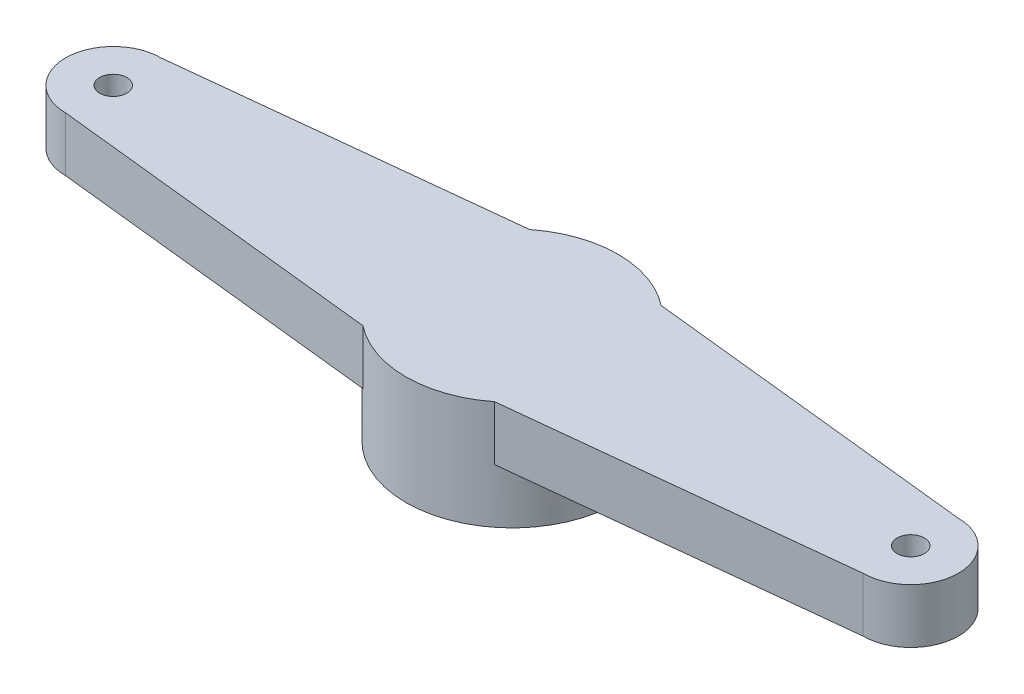
ISO-10303-21;
HEADER;
FILE_DESCRIPTION(('STEP AP214'),'2;1');
FILE_NAME('part.step','',(''),(''),'','','');
FILE_SCHEMA(('AUTOMOTIVE_DESIGN { 1 0 10303 214 1 1 1 1 }'));
ENDSEC;
DATA;
#1=APPLICATION_CONTEXT('core data for automotive mechanical design processes');
#2=APPLICATION_PROTOCOL_DEFINITION('international standard','automotive_design',2000,#1);
#3=PRODUCT_CONTEXT('',#1,'mechanical');
#4=PRODUCT('Part','Part','',(#3));
#5=PRODUCT_RELATED_PRODUCT_CATEGORY('part','',(#4));
#6=PRODUCT_DEFINITION_FORMATION('','',#4);
#7=PRODUCT_DEFINITION_CONTEXT('part definition',#1,'design');
#8=PRODUCT_DEFINITION('design','',#6,#7);
#9=PRODUCT_DEFINITION_SHAPE('','',#8);
#10=(LENGTH_UNIT() NAMED_UNIT(*) SI_UNIT(.MILLI.,.METRE.));
#11=(NAMED_UNIT(*) PLANE_ANGLE_UNIT() SI_UNIT($,.RADIAN.));
#12=(NAMED_UNIT(*) SI_UNIT($,.STERADIAN.) SOLID_ANGLE_UNIT());
#13=UNCERTAINTY_MEASURE_WITH_UNIT(LENGTH_MEASURE(1.E-05),#10,'distance_accuracy_value','');
#14=(GEOMETRIC_REPRESENTATION_CONTEXT(3) GLOBAL_UNCERTAINTY_ASSIGNED_CONTEXT((#13)) GLOBAL_UNIT_ASSIGNED_CONTEXT((#10,
#11,#12)) REPRESENTATION_CONTEXT('',''));
#15=CARTESIAN_POINT('',(0.,0.,0.));
#16=DIRECTION('',(0.,0.,1.));
#17=DIRECTION('',(1.,0.,0.));
#18=AXIS2_PLACEMENT_3D('',#15,#16,#17);
#19=CARTESIAN_POINT('',(-5.70664134658746,-2.,37.4291539918414));
#20=DIRECTION('',(0.,1.,0.));
#21=DIRECTION('',(0.,0.,1.));
#22=AXIS2_PLACEMENT_3D('',#19,#20,#21);
#23=CYLINDRICAL_SURFACE('',#22,3.9);
#24=CARTESIAN_POINT('',(-5.70664134658746,-2.,37.4291539918414));
#25=DIRECTION('',(0.,1.,0.));
#26=DIRECTION('',(0.,0.,1.));
#27=AXIS2_PLACEMENT_3D('',#24,#25,#26);
#28=CIRCLE('',#27,3.9);
#29=CARTESIAN_POINT('',(-5.70664134658746,-2.,41.3291539918414));
#30=VERTEX_POINT('',#29);
#31=EDGE_CURVE('E140',#30,#30,#28,.T.);
#32=ORIENTED_EDGE('',*,*,#31,.T.);
#33=EDGE_LOOP('',(#32));
#34=FACE_BOUND('',#33,.T.);
#35=CARTESIAN_POINT('',(-5.70664134658746,0.,37.4291539918414));
#36=DIRECTION('',(0.,-1.,0.));
#37=DIRECTION('',(0.,0.,-1.));
#38=AXIS2_PLACEMENT_3D('',#35,#36,#37);
#39=CIRCLE('',#38,3.9);
#40=CARTESIAN_POINT('',(-8.12308083620216,0.,34.3679744490784));
#41=VERTEX_POINT('',#40);
#42=CARTESIAN_POINT('',(-8.12308083620216,0.,40.4903335346044));
#43=VERTEX_POINT('',#42);
#44=EDGE_CURVE('E11',#41,#43,#39,.F.);
#45=ORIENTED_EDGE('',*,*,#44,.F.);
#46=DIRECTION('',(0.,1.,0.));
#47=VECTOR('',#46,1.);
#48=CARTESIAN_POINT('',(-8.12308083620216,-2.,34.3679744490784));
#49=LINE('',#48,#47);
#50=CARTESIAN_POINT('',(-8.12308083620216,2.,34.3679744490784));
#51=VERTEX_POINT('',#50);
#52=EDGE_CURVE('E134',#41,#51,#49,.T.);
#53=ORIENTED_EDGE('',*,*,#52,.T.);
#54=CARTESIAN_POINT('',(-5.70664134658746,2.,37.4291539918414));
#55=DIRECTION('',(0.,1.,0.));
#56=DIRECTION('',(0.,0.,1.));
#57=AXIS2_PLACEMENT_3D('',#54,#55,#56);
#58=CIRCLE('',#57,3.9);
#59=CARTESIAN_POINT('',(-3.29020185697275,2.,34.3679744490784));
#60=VERTEX_POINT('',#59);
#61=EDGE_CURVE('E139',#60,#51,#58,.T.);
#62=ORIENTED_EDGE('',*,*,#61,.F.);
#63=DIRECTION('',(0.,1.,0.));
#64=VECTOR('',#63,1.);
#65=CARTESIAN_POINT('',(-3.29020185697275,-2.,34.3679744490784));
#66=LINE('',#65,#64);
#67=CARTESIAN_POINT('',(-3.29020185697275,0.,34.3679744490784));
#68=VERTEX_POINT('',#67);
#69=EDGE_CURVE('E104',#60,#68,#66,.F.);
#70=ORIENTED_EDGE('',*,*,#69,.T.);
#71=CARTESIAN_POINT('',(-3.29020185697275,0.,40.4903335346044));
#72=VERTEX_POINT('',#71);
#73=EDGE_CURVE('E35',#72,#68,#39,.F.);
#74=ORIENTED_EDGE('',*,*,#73,.F.);
#75=DIRECTION('',(0.,1.,0.));
#76=VECTOR('',#75,1.);
#77=CARTESIAN_POINT('',(-3.29020185697275,-2.,40.4903335346044));
#78=LINE('',#77,#76);
#79=CARTESIAN_POINT('',(-3.29020185697275,2.,40.4903335346044));
#80=VERTEX_POINT('',#79);
#81=EDGE_CURVE('E122',#72,#80,#78,.T.);
#82=ORIENTED_EDGE('',*,*,#81,.T.);
#83=CARTESIAN_POINT('',(-8.12308083620216,2.,40.4903335346044));
#84=VERTEX_POINT('',#83);
#85=EDGE_CURVE('E138',#84,#80,#58,.T.);
#86=ORIENTED_EDGE('',*,*,#85,.F.);
#87=DIRECTION('',(0.,1.,0.));
#88=VECTOR('',#87,1.);
#89=CARTESIAN_POINT('',(-8.12308083620216,-2.,40.4903335346044));
#90=LINE('',#89,#88);
#91=EDGE_CURVE('E125',#84,#43,#90,.F.);
#92=ORIENTED_EDGE('',*,*,#91,.T.);
#93=EDGE_LOOP('',(#45,#53,#62,#70,#74,#82,#86,#92));
#94=FACE_BOUND('',#93,.T.);
#95=ADVANCED_FACE('F32',(#34,#94),#23,.T.);
#96=CARTESIAN_POINT('',(-5.70664134658746,-2.,37.4291539918414));
#97=DIRECTION('',(0.,1.,0.));
#98=DIRECTION('',(0.,0.,1.));
#99=AXIS2_PLACEMENT_3D('',#96,#97,#98);
#100=PLANE('',#99);
#101=CARTESIAN_POINT('',(-5.70664134658746,-2.,37.4291539918414));
#102=DIRECTION('',(0.,1.,0.));
#103=DIRECTION('',(0.,0.,1.));
#104=AXIS2_PLACEMENT_3D('',#101,#102,#103);
#105=CIRCLE('',#104,2.25);
#106=CARTESIAN_POINT('',(-5.70664134658746,-2.,39.6791539918414));
#107=VERTEX_POINT('',#106);
#108=EDGE_CURVE('E191',#107,#107,#105,.T.);
#109=ORIENTED_EDGE('',*,*,#108,.T.);
#110=EDGE_LOOP('',(#109));
#111=FACE_BOUND('',#110,.T.);
#112=ORIENTED_EDGE('',*,*,#31,.F.);
#113=EDGE_LOOP('',(#112));
#114=FACE_BOUND('',#113,.T.);
#115=ADVANCED_FACE('F200',(#111,#114),#100,.F.);
#116=CARTESIAN_POINT('',(-5.70664134658746,2.,37.4291539918414));
#117=DIRECTION('',(0.,1.,0.));
#118=DIRECTION('',(0.,0.,1.));
#119=AXIS2_PLACEMENT_3D('',#116,#117,#118);
#120=PLANE('',#119);
#121=ORIENTED_EDGE('',*,*,#85,.T.);
#122=DIRECTION('',(0.994305357259751,0.,-0.106568553169119));
#123=VECTOR('',#122,1.);
#124=CARTESIAN_POINT('',(8.94335865341254,2.,39.1791539918414));
#125=LINE('',#124,#123);
#126=CARTESIAN_POINT('',(8.94335865341254,2.,39.1791539918414));
#127=VERTEX_POINT('',#126);
#128=EDGE_CURVE('E53',#80,#127,#125,.T.);
#129=ORIENTED_EDGE('',*,*,#128,.T.);
#130=CARTESIAN_POINT('',(8.94335865341254,2.,37.4291539918414));
#131=DIRECTION('',(0.,1.,0.));
#132=DIRECTION('',(0.,0.,-1.));
#133=AXIS2_PLACEMENT_3D('',#130,#131,#132);
#134=CIRCLE('',#133,1.75);
#135=CARTESIAN_POINT('',(8.94335865341254,2.,35.6791539918414));
#136=VERTEX_POINT('',#135);
#137=EDGE_CURVE('E109',#127,#136,#134,.T.);
#138=ORIENTED_EDGE('',*,*,#137,.T.);
#139=DIRECTION('',(-0.994305357259751,0.,-0.106568553169119));
#140=VECTOR('',#139,1.);
#141=CARTESIAN_POINT('',(8.94335865341254,2.,35.6791539918414));
#142=LINE('',#141,#140);
#143=EDGE_CURVE('E96',#136,#60,#142,.T.);
#144=ORIENTED_EDGE('',*,*,#143,.T.);
#145=ORIENTED_EDGE('',*,*,#61,.T.);
#146=DIRECTION('',(-0.994305357259751,0.,0.106568553169119));
#147=VECTOR('',#146,1.);
#148=CARTESIAN_POINT('',(-20.3566413465875,2.,35.6791539918414));
#149=LINE('',#148,#147);
#150=CARTESIAN_POINT('',(-20.3566413465875,2.,35.6791539918414));
#151=VERTEX_POINT('',#150);
#152=EDGE_CURVE('E108',#51,#151,#149,.T.);
#153=ORIENTED_EDGE('',*,*,#152,.T.);
#154=CARTESIAN_POINT('',(-20.3566413465875,2.,37.4291539918414));
#155=DIRECTION('',(0.,1.,0.));
#156=DIRECTION('',(0.,0.,1.));
#157=AXIS2_PLACEMENT_3D('',#154,#155,#156);
#158=CIRCLE('',#157,1.75);
#159=CARTESIAN_POINT('',(-20.3566413465875,2.,39.1791539918414));
#160=VERTEX_POINT('',#159);
#161=EDGE_CURVE('E173',#151,#160,#158,.T.);
#162=ORIENTED_EDGE('',*,*,#161,.T.);
#163=DIRECTION('',(0.994305357259751,0.,0.106568553169119));
#164=VECTOR('',#163,1.);
#165=CARTESIAN_POINT('',(-20.3566413465875,2.,39.1791539918414));
#166=LINE('',#165,#164);
#167=EDGE_CURVE('E169',#160,#84,#166,.T.);
#168=ORIENTED_EDGE('',*,*,#167,.T.);
#169=EDGE_LOOP('',(#121,#129,#138,#144,#145,#153,#162,#168));
#170=FACE_BOUND('',#169,.T.);
#171=CARTESIAN_POINT('',(8.94335865341254,2.,37.4291539918414));
#172=DIRECTION('',(0.,1.,0.));
#173=DIRECTION('',(0.,0.,-1.));
#174=AXIS2_PLACEMENT_3D('',#171,#172,#173);
#175=CIRCLE('',#174,0.500000000000001);
#176=CARTESIAN_POINT('',(8.94335865341254,2.,36.9291539918414));
#177=VERTEX_POINT('',#176);
#178=EDGE_CURVE('E178',#177,#177,#175,.T.);
#179=ORIENTED_EDGE('',*,*,#178,.F.);
#180=EDGE_LOOP('',(#179));
#181=FACE_BOUND('',#180,.T.);
#182=CARTESIAN_POINT('',(-20.3566413465875,2.,37.4291539918414));
#183=DIRECTION('',(0.,1.,0.));
#184=DIRECTION('',(0.,0.,1.));
#185=AXIS2_PLACEMENT_3D('',#182,#183,#184);
#186=CIRCLE('',#185,0.499999999999999);
#187=CARTESIAN_POINT('',(-20.3566413465875,2.,37.9291539918414));
#188=VERTEX_POINT('',#187);
#189=EDGE_CURVE('E185',#188,#188,#186,.T.);
#190=ORIENTED_EDGE('',*,*,#189,.F.);
#191=EDGE_LOOP('',(#190));
#192=FACE_BOUND('',#191,.T.);
#193=ADVANCED_FACE('F113',(#170,#181,#192),#120,.T.);
#194=CARTESIAN_POINT('',(8.94335865341254,2.,37.4291539918414));
#195=DIRECTION('',(0.,-1.,0.));
#196=DIRECTION('',(0.,0.,-1.));
#197=AXIS2_PLACEMENT_3D('',#194,#195,#196);
#198=CYLINDRICAL_SURFACE('',#197,0.500000000000001);
#199=ORIENTED_EDGE('',*,*,#178,.T.);
#200=EDGE_LOOP('',(#199));
#201=FACE_BOUND('',#200,.T.);
#202=CARTESIAN_POINT('',(8.94335865341254,0.,37.4291539918414));
#203=DIRECTION('',(0.,1.,0.));
#204=DIRECTION('',(0.,0.,-1.));
#205=AXIS2_PLACEMENT_3D('',#202,#203,#204);
#206=CIRCLE('',#205,0.500000000000001);
#207=CARTESIAN_POINT('',(8.94335865341254,0.,36.9291539918414));
#208=VERTEX_POINT('',#207);
#209=EDGE_CURVE('E180',#208,#208,#206,.T.);
#210=ORIENTED_EDGE('',*,*,#209,.F.);
#211=EDGE_LOOP('',(#210));
#212=FACE_BOUND('',#211,.T.);
#213=ADVANCED_FACE('F222',(#201,#212),#198,.F.);
#214=CARTESIAN_POINT('',(8.94335865341254,2.,37.4291539918414));
#215=DIRECTION('',(0.,-1.,0.));
#216=DIRECTION('',(0.,0.,-1.));
#217=AXIS2_PLACEMENT_3D('',#214,#215,#216);
#218=CYLINDRICAL_SURFACE('',#217,1.75);
#219=CARTESIAN_POINT('',(8.94335865341254,0.,37.4291539918414));
#220=DIRECTION('',(0.,1.,0.));
#221=DIRECTION('',(0.,0.,-1.));
#222=AXIS2_PLACEMENT_3D('',#219,#220,#221);
#223=CIRCLE('',#222,1.75);
#224=CARTESIAN_POINT('',(8.94335865341254,0.,39.1791539918414));
#225=VERTEX_POINT('',#224);
#226=CARTESIAN_POINT('',(8.94335865341254,0.,35.6791539918414));
#227=VERTEX_POINT('',#226);
#228=EDGE_CURVE('E121',#225,#227,#223,.T.);
#229=ORIENTED_EDGE('',*,*,#228,.T.);
#230=DIRECTION('',(0.,-1.,0.));
#231=VECTOR('',#230,1.);
#232=CARTESIAN_POINT('',(8.94335865341254,2.,35.6791539918414));
#233=LINE('',#232,#231);
#234=EDGE_CURVE('E101',#136,#227,#233,.T.);
#235=ORIENTED_EDGE('',*,*,#234,.F.);
#236=ORIENTED_EDGE('',*,*,#137,.F.);
#237=DIRECTION('',(0.,-1.,0.));
#238=VECTOR('',#237,1.);
#239=CARTESIAN_POINT('',(8.94335865341254,2.,39.1791539918414));
#240=LINE('',#239,#238);
#241=EDGE_CURVE('E164',#127,#225,#240,.T.);
#242=ORIENTED_EDGE('',*,*,#241,.T.);
#243=EDGE_LOOP('',(#229,#235,#236,#242));
#244=FACE_BOUND('',#243,.T.);
#245=ADVANCED_FACE('F119',(#244),#218,.T.);
#246=CARTESIAN_POINT('',(8.94335865341254,2.,35.6791539918414));
#247=DIRECTION('',(-0.106568553169119,0.,0.994305357259751));
#248=DIRECTION('',(0.994305357259751,0.,0.106568553169119));
#249=AXIS2_PLACEMENT_3D('',#246,#247,#248);
#250=PLANE('',#249);
#251=ORIENTED_EDGE('',*,*,#69,.F.);
#252=ORIENTED_EDGE('',*,*,#143,.F.);
#253=ORIENTED_EDGE('',*,*,#234,.T.);
#254=DIRECTION('',(-0.994305357259751,0.,-0.106568553169119));
#255=VECTOR('',#254,1.);
#256=CARTESIAN_POINT('',(8.94335865341254,0.,35.6791539918414));
#257=LINE('',#256,#255);
#258=EDGE_CURVE('E156',#227,#68,#257,.T.);
#259=ORIENTED_EDGE('',*,*,#258,.T.);
#260=EDGE_LOOP('',(#251,#252,#253,#259));
#261=FACE_BOUND('',#260,.T.);
#262=ADVANCED_FACE('F98',(#261),#250,.F.);
#263=CARTESIAN_POINT('',(8.94335865341254,2.,39.1791539918414));
#264=DIRECTION('',(-0.106568553169119,0.,-0.994305357259751));
#265=DIRECTION('',(-0.994305357259751,0.,0.106568553169119));
#266=AXIS2_PLACEMENT_3D('',#263,#264,#265);
#267=PLANE('',#266);
#268=ORIENTED_EDGE('',*,*,#81,.F.);
#269=DIRECTION('',(0.994305357259751,0.,-0.106568553169119));
#270=VECTOR('',#269,1.);
#271=CARTESIAN_POINT('',(8.94335865341254,0.,39.1791539918414));
#272=LINE('',#271,#270);
#273=EDGE_CURVE('E117',#72,#225,#272,.T.);
#274=ORIENTED_EDGE('',*,*,#273,.T.);
#275=ORIENTED_EDGE('',*,*,#241,.F.);
#276=ORIENTED_EDGE('',*,*,#128,.F.);
#277=EDGE_LOOP('',(#268,#274,#275,#276));
#278=FACE_BOUND('',#277,.T.);
#279=ADVANCED_FACE('F229',(#278),#267,.F.);
#280=CARTESIAN_POINT('',(8.94335865341254,0.,37.4291539918414));
#281=DIRECTION('',(0.,-1.,0.));
#282=DIRECTION('',(0.,0.,-1.));
#283=AXIS2_PLACEMENT_3D('',#280,#281,#282);
#284=PLANE('',#283);
#285=ORIENTED_EDGE('',*,*,#209,.T.);
#286=EDGE_LOOP('',(#285));
#287=FACE_BOUND('',#286,.T.);
#288=ORIENTED_EDGE('',*,*,#273,.F.);
#289=ORIENTED_EDGE('',*,*,#73,.T.);
#290=ORIENTED_EDGE('',*,*,#258,.F.);
#291=ORIENTED_EDGE('',*,*,#228,.F.);
#292=EDGE_LOOP('',(#288,#289,#290,#291));
#293=FACE_BOUND('',#292,.T.);
#294=ADVANCED_FACE('F238',(#287,#293),#284,.T.);
#295=CARTESIAN_POINT('',(-20.3566413465875,0.,37.4291539918414));
#296=DIRECTION('',(0.,1.,0.));
#297=DIRECTION('',(0.,0.,1.));
#298=AXIS2_PLACEMENT_3D('',#295,#296,#297);
#299=CIRCLE('',#298,0.499999999999999);
#300=CARTESIAN_POINT('',(-20.3566413465875,0.,37.9291539918414));
#301=VERTEX_POINT('',#300);
#302=EDGE_CURVE('E188',#301,#301,#299,.T.);
#303=ORIENTED_EDGE('',*,*,#302,.T.);
#304=EDGE_LOOP('',(#303));
#305=FACE_BOUND('',#304,.T.);
#306=DIRECTION('',(-0.994305357259751,0.,0.106568553169119));
#307=VECTOR('',#306,1.);
#308=CARTESIAN_POINT('',(-20.3566413465875,0.,35.6791539918414));
#309=LINE('',#308,#307);
#310=CARTESIAN_POINT('',(-20.3566413465875,0.,35.6791539918414));
#311=VERTEX_POINT('',#310);
#312=EDGE_CURVE('E151',#41,#311,#309,.T.);
#313=ORIENTED_EDGE('',*,*,#312,.F.);
#314=ORIENTED_EDGE('',*,*,#44,.T.);
#315=DIRECTION('',(0.994305357259751,0.,0.106568553169119));
#316=VECTOR('',#315,1.);
#317=CARTESIAN_POINT('',(-20.3566413465875,0.,39.1791539918414));
#318=LINE('',#317,#316);
#319=CARTESIAN_POINT('',(-20.3566413465875,0.,39.1791539918414));
#320=VERTEX_POINT('',#319);
#321=EDGE_CURVE('E46',#320,#43,#318,.T.);
#322=ORIENTED_EDGE('',*,*,#321,.F.);
#323=CARTESIAN_POINT('',(-20.3566413465875,0.,37.4291539918414));
#324=DIRECTION('',(0.,1.,0.));
#325=DIRECTION('',(0.,0.,1.));
#326=AXIS2_PLACEMENT_3D('',#323,#324,#325);
#327=CIRCLE('',#326,1.75);
#328=EDGE_CURVE('E155',#311,#320,#327,.T.);
#329=ORIENTED_EDGE('',*,*,#328,.F.);
#330=EDGE_LOOP('',(#313,#314,#322,#329));
#331=FACE_BOUND('',#330,.T.);
#332=ADVANCED_FACE('F154',(#305,#331),#284,.T.);
#333=CARTESIAN_POINT('',(-20.3566413465875,2.,35.6791539918414));
#334=DIRECTION('',(0.106568553169119,0.,0.994305357259751));
#335=DIRECTION('',(0.994305357259751,0.,-0.106568553169119));
#336=AXIS2_PLACEMENT_3D('',#333,#334,#335);
#337=PLANE('',#336);
#338=ORIENTED_EDGE('',*,*,#52,.F.);
#339=ORIENTED_EDGE('',*,*,#312,.T.);
#340=DIRECTION('',(0.,-1.,0.));
#341=VECTOR('',#340,1.);
#342=CARTESIAN_POINT('',(-20.3566413465875,2.,35.6791539918414));
#343=LINE('',#342,#341);
#344=EDGE_CURVE('E123',#151,#311,#343,.T.);
#345=ORIENTED_EDGE('',*,*,#344,.F.);
#346=ORIENTED_EDGE('',*,*,#152,.F.);
#347=EDGE_LOOP('',(#338,#339,#345,#346));
#348=FACE_BOUND('',#347,.T.);
#349=ADVANCED_FACE('F150',(#348),#337,.F.);
#350=CARTESIAN_POINT('',(-20.3566413465875,2.,37.4291539918414));
#351=DIRECTION('',(0.,-1.,0.));
#352=DIRECTION('',(0.,0.,-1.));
#353=AXIS2_PLACEMENT_3D('',#350,#351,#352);
#354=CYLINDRICAL_SURFACE('',#353,1.75);
#355=ORIENTED_EDGE('',*,*,#328,.T.);
#356=DIRECTION('',(0.,-1.,0.));
#357=VECTOR('',#356,1.);
#358=CARTESIAN_POINT('',(-20.3566413465875,2.,39.1791539918414));
#359=LINE('',#358,#357);
#360=EDGE_CURVE('E128',#160,#320,#359,.T.);
#361=ORIENTED_EDGE('',*,*,#360,.F.);
#362=ORIENTED_EDGE('',*,*,#161,.F.);
#363=ORIENTED_EDGE('',*,*,#344,.T.);
#364=EDGE_LOOP('',(#355,#361,#362,#363));
#365=FACE_BOUND('',#364,.T.);
#366=ADVANCED_FACE('F172',(#365),#354,.T.);
#367=CARTESIAN_POINT('',(-20.3566413465875,2.,39.1791539918414));
#368=DIRECTION('',(0.106568553169119,0.,-0.994305357259751));
#369=DIRECTION('',(-0.994305357259751,0.,-0.106568553169119));
#370=AXIS2_PLACEMENT_3D('',#367,#368,#369);
#371=PLANE('',#370);
#372=ORIENTED_EDGE('',*,*,#91,.F.);
#373=ORIENTED_EDGE('',*,*,#167,.F.);
#374=ORIENTED_EDGE('',*,*,#360,.T.);
#375=ORIENTED_EDGE('',*,*,#321,.T.);
#376=EDGE_LOOP('',(#372,#373,#374,#375));
#377=FACE_BOUND('',#376,.T.);
#378=ADVANCED_FACE('F167',(#377),#371,.F.);
#379=CARTESIAN_POINT('',(-20.3566413465875,2.,37.4291539918414));
#380=DIRECTION('',(0.,-1.,0.));
#381=DIRECTION('',(0.,0.,-1.));
#382=AXIS2_PLACEMENT_3D('',#379,#380,#381);
#383=CYLINDRICAL_SURFACE('',#382,0.499999999999999);
#384=ORIENTED_EDGE('',*,*,#189,.T.);
#385=EDGE_LOOP('',(#384));
#386=FACE_BOUND('',#385,.T.);
#387=ORIENTED_EDGE('',*,*,#302,.F.);
#388=EDGE_LOOP('',(#387));
#389=FACE_BOUND('',#388,.T.);
#390=ADVANCED_FACE('F207',(#386,#389),#383,.F.);
#391=CARTESIAN_POINT('',(-5.70664134658746,-2.,37.4291539918414));
#392=DIRECTION('',(0.,1.,0.));
#393=DIRECTION('',(0.,0.,1.));
#394=AXIS2_PLACEMENT_3D('',#391,#392,#393);
#395=CYLINDRICAL_SURFACE('',#394,2.25);
#396=ORIENTED_EDGE('',*,*,#108,.F.);
#397=EDGE_LOOP('',(#396));
#398=FACE_BOUND('',#397,.T.);
#399=CARTESIAN_POINT('',(-5.70664134658746,0.,37.4291539918414));
#400=DIRECTION('',(0.,1.,0.));
#401=DIRECTION('',(0.,0.,1.));
#402=AXIS2_PLACEMENT_3D('',#399,#400,#401);
#403=CIRCLE('',#402,2.25);
#404=CARTESIAN_POINT('',(-5.70664134658746,0.,39.6791539918414));
#405=VERTEX_POINT('',#404);
#406=EDGE_CURVE('E194',#405,#405,#403,.T.);
#407=ORIENTED_EDGE('',*,*,#406,.T.);
#408=EDGE_LOOP('',(#407));
#409=FACE_BOUND('',#408,.T.);
#410=ADVANCED_FACE('F203',(#398,#409),#395,.F.);
#411=CARTESIAN_POINT('',(-5.70664134658746,0.,37.4291539918414));
#412=DIRECTION('',(0.,1.,0.));
#413=DIRECTION('',(0.,0.,1.));
#414=AXIS2_PLACEMENT_3D('',#411,#412,#413);
#415=PLANE('',#414);
#416=ORIENTED_EDGE('',*,*,#406,.F.);
#417=EDGE_LOOP('',(#416));
#418=FACE_BOUND('',#417,.T.);
#419=ADVANCED_FACE('F206',(#418),#415,.F.);
#420=CLOSED_SHELL('',(#95,#115,#193,#213,#245,#262,#279,#294,#332,#349,#366,#378,#390,#410,#419));
#421=MANIFOLD_SOLID_BREP('B2',#420);
#422=ADVANCED_BREP_SHAPE_REPRESENTATION('',(#18,#421),#14);
#423=SHAPE_DEFINITION_REPRESENTATION(#9,#422);
ENDSEC;
END-ISO-10303-21;
